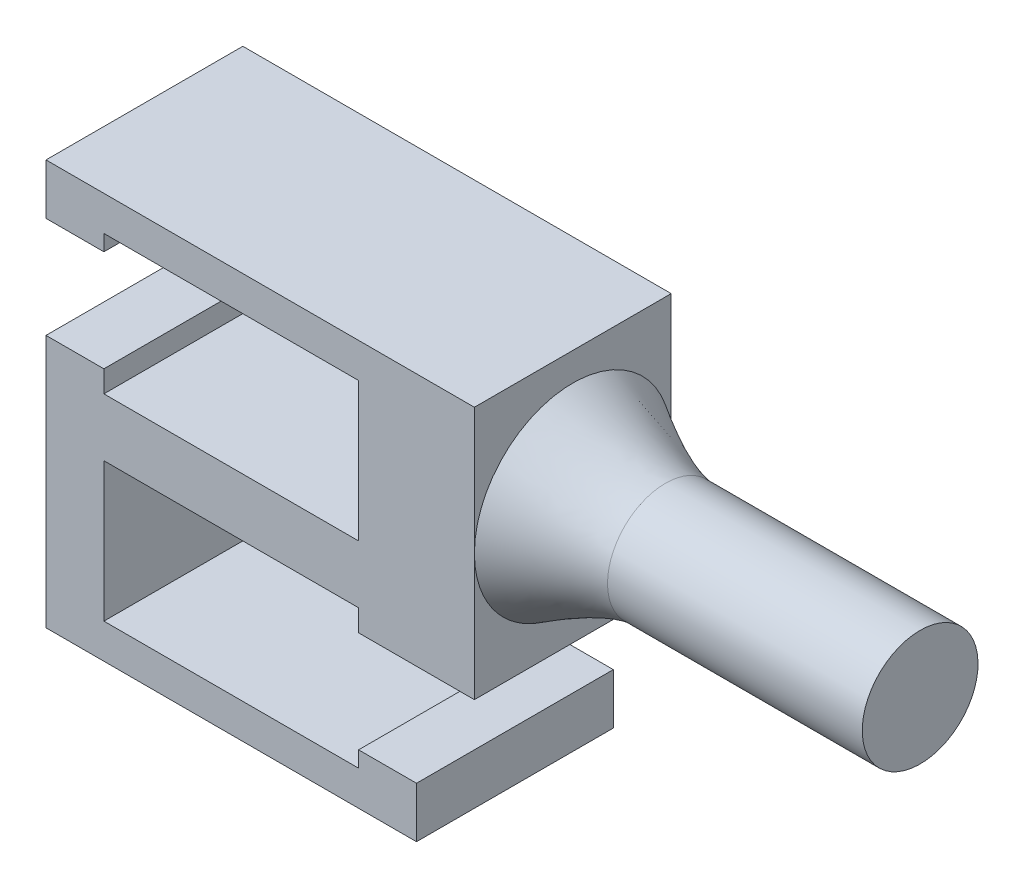
ISO-10303-21;
HEADER;
FILE_DESCRIPTION(('STEP AP214'),'2;1');
FILE_NAME('part.step','',(''),(''),'','','');
FILE_SCHEMA(('AUTOMOTIVE_DESIGN { 1 0 10303 214 1 1 1 1 }'));
ENDSEC;
DATA;
#1=APPLICATION_CONTEXT('core data for automotive mechanical design processes');
#2=APPLICATION_PROTOCOL_DEFINITION('international standard','automotive_design',2000,#1);
#3=PRODUCT_CONTEXT('',#1,'mechanical');
#4=PRODUCT('Part','Part','',(#3));
#5=PRODUCT_RELATED_PRODUCT_CATEGORY('part','',(#4));
#6=PRODUCT_DEFINITION_FORMATION('','',#4);
#7=PRODUCT_DEFINITION_CONTEXT('part definition',#1,'design');
#8=PRODUCT_DEFINITION('design','',#6,#7);
#9=PRODUCT_DEFINITION_SHAPE('','',#8);
#10=(LENGTH_UNIT() NAMED_UNIT(*) SI_UNIT(.MILLI.,.METRE.));
#11=(NAMED_UNIT(*) PLANE_ANGLE_UNIT() SI_UNIT($,.RADIAN.));
#12=(NAMED_UNIT(*) SI_UNIT($,.STERADIAN.) SOLID_ANGLE_UNIT());
#13=UNCERTAINTY_MEASURE_WITH_UNIT(LENGTH_MEASURE(1.E-05),#10,'distance_accuracy_value','');
#14=(GEOMETRIC_REPRESENTATION_CONTEXT(3) GLOBAL_UNCERTAINTY_ASSIGNED_CONTEXT((#13)) GLOBAL_UNIT_ASSIGNED_CONTEXT((#10,
#11,#12)) REPRESENTATION_CONTEXT('',''));
#15=CARTESIAN_POINT('',(0.,0.,0.));
#16=DIRECTION('',(0.,0.,1.));
#17=DIRECTION('',(1.,0.,0.));
#18=AXIS2_PLACEMENT_3D('',#15,#16,#17);
#19=CARTESIAN_POINT('',(21.1122382547684,0.,0.));
#20=DIRECTION('',(1.,0.,0.));
#21=DIRECTION('',(0.,1.,0.));
#22=AXIS2_PLACEMENT_3D('',#19,#20,#21);
#23=PLANE('',#22);
#24=DIRECTION('',(0.,1.,0.));
#25=VECTOR('',#24,1.);
#26=CARTESIAN_POINT('',(21.1122382547684,75.9799365132959,32.));
#27=LINE('',#26,#25);
#28=CARTESIAN_POINT('',(21.1122382547684,54.1049365132959,32.));
#29=VERTEX_POINT('',#28);
#30=CARTESIAN_POINT('',(21.1122382547684,65.0421631936669,32.));
#31=VERTEX_POINT('',#30);
#32=EDGE_CURVE('E224',#29,#31,#27,.T.);
#33=ORIENTED_EDGE('',*,*,#32,.F.);
#34=DIRECTION('',(0.,0.,1.));
#35=VECTOR('',#34,1.);
#36=CARTESIAN_POINT('',(21.1122382547684,54.1049365132959,15.));
#37=LINE('',#36,#35);
#38=CARTESIAN_POINT('',(21.1122382547684,54.1049365132959,15.));
#39=VERTEX_POINT('',#38);
#40=EDGE_CURVE('E207',#39,#29,#37,.T.);
#41=ORIENTED_EDGE('',*,*,#40,.F.);
#42=DIRECTION('',(0.,-1.,0.));
#43=VECTOR('',#42,1.);
#44=CARTESIAN_POINT('',(21.1122382547684,75.9799365132959,15.));
#45=LINE('',#44,#43);
#46=CARTESIAN_POINT('',(21.1122382547684,65.0427098329382,15.));
#47=VERTEX_POINT('',#46);
#48=EDGE_CURVE('E201',#47,#39,#45,.T.);
#49=ORIENTED_EDGE('',*,*,#48,.F.);
#50=CARTESIAN_POINT('',(21.1122382547684,72.8146764351576,20.0587376448433));
#51=CARTESIAN_POINT('',(21.1122382547684,79.697201145471,35.6032174885667));
#52=CARTESIAN_POINT('',(21.1122382547684,64.1527213017475,42.4857421988802));
#53=CARTESIAN_POINT('',(21.1122382547684,57.2701965914341,26.9412623551567));
#54=CARTESIAN_POINT('',(21.1122382547684,50.3876718811207,11.3967825114333));
#55=CARTESIAN_POINT('',(21.1122382547684,65.9321517248442,4.51425780111984));
#56=CARTESIAN_POINT('',(21.1122382547684,72.8146764351576,20.0587376448433));
#57=(BOUNDED_CURVE() B_SPLINE_CURVE(3,(#50,#51,#52,#53,#54,#55,#56),.UNSPECIFIED.,.T.,
.F.) B_SPLINE_CURVE_WITH_KNOTS((4,3,4),(0.,0.5,1.),
.UNSPECIFIED.) CURVE() GEOMETRIC_REPRESENTATION_ITEM() RATIONAL_B_SPLINE_CURVE((1.,
0.333333333333333,0.333333333333333,1.,0.333333333333333,0.333333333333333,1.)) REPRESENTATION_ITEM(''));
#58=EDGE_CURVE('E193',#47,#31,#57,.F.);
#59=ORIENTED_EDGE('',*,*,#58,.T.);
#60=EDGE_LOOP('',(#33,#41,#49,#59));
#61=FACE_BOUND('',#60,.T.);
#62=ADVANCED_FACE('F43',(#61),#23,.T.);
#63=CARTESIAN_POINT('',(21.1122382547684,75.9799365132959,15.));
#64=VERTEX_POINT('',#63);
#65=EDGE_CURVE('E189',#64,#47,#45,.T.);
#66=ORIENTED_EDGE('',*,*,#65,.F.);
#67=DIRECTION('',(0.,0.,-1.));
#68=VECTOR('',#67,1.);
#69=CARTESIAN_POINT('',(21.1122382547684,75.9799365132959,15.));
#70=LINE('',#69,#68);
#71=CARTESIAN_POINT('',(21.1122382547684,75.9799365132959,32.));
#72=VERTEX_POINT('',#71);
#73=EDGE_CURVE('E233',#72,#64,#70,.T.);
#74=ORIENTED_EDGE('',*,*,#73,.F.);
#75=EDGE_CURVE('E191',#31,#72,#27,.T.);
#76=ORIENTED_EDGE('',*,*,#75,.F.);
#77=CARTESIAN_POINT('',(21.1122382547684,65.0424365132959,23.5));
#78=DIRECTION('',(-1.,0.,0.));
#79=DIRECTION('',(0.,1.,0.));
#80=AXIS2_PLACEMENT_3D('',#77,#78,#79);
#81=CIRCLE('',#80,8.49999999999999);
#82=EDGE_CURVE('E59',#31,#47,#81,.T.);
#83=ORIENTED_EDGE('',*,*,#82,.T.);
#84=EDGE_LOOP('',(#66,#74,#76,#83));
#85=FACE_BOUND('',#84,.T.);
#86=ADVANCED_FACE('F187',(#85),#23,.T.);
#87=CARTESIAN_POINT('',(16.1122382547684,0.,35.));
#88=DIRECTION('',(-1.,0.,0.));
#89=DIRECTION('',(0.,-1.,0.));
#90=AXIS2_PLACEMENT_3D('',#87,#88,#89);
#91=PLANE('',#90);
#92=DIRECTION('',(0.,0.,-1.));
#93=VECTOR('',#92,1.);
#94=CARTESIAN_POINT('',(16.1122382547684,40.9799365132959,35.));
#95=LINE('',#94,#93);
#96=CARTESIAN_POINT('',(16.1122382547684,40.9799365132959,32.));
#97=VERTEX_POINT('',#96);
#98=CARTESIAN_POINT('',(16.1122382547684,40.9799365132959,15.));
#99=VERTEX_POINT('',#98);
#100=EDGE_CURVE('E52',#97,#99,#95,.T.);
#101=ORIENTED_EDGE('',*,*,#100,.T.);
#102=DIRECTION('',(0.,1.,0.));
#103=VECTOR('',#102,1.);
#104=CARTESIAN_POINT('',(16.1122382547684,75.9799365132959,15.));
#105=LINE('',#104,#103);
#106=CARTESIAN_POINT('',(16.1122382547684,45.3549365132959,15.));
#107=VERTEX_POINT('',#106);
#108=EDGE_CURVE('E408',#99,#107,#105,.T.);
#109=ORIENTED_EDGE('',*,*,#108,.T.);
#110=DIRECTION('',(0.,0.,1.));
#111=VECTOR('',#110,1.);
#112=CARTESIAN_POINT('',(16.1122382547684,45.3549365132959,35.));
#113=LINE('',#112,#111);
#114=CARTESIAN_POINT('',(16.1122382547684,45.3549365132959,32.));
#115=VERTEX_POINT('',#114);
#116=EDGE_CURVE('E384',#107,#115,#113,.T.);
#117=ORIENTED_EDGE('',*,*,#116,.T.);
#118=DIRECTION('',(0.,1.,0.));
#119=VECTOR('',#118,1.);
#120=CARTESIAN_POINT('',(16.1122382547684,75.9799365132959,32.));
#121=LINE('',#120,#119);
#122=EDGE_CURVE('E477',#97,#115,#121,.T.);
#123=ORIENTED_EDGE('',*,*,#122,.F.);
#124=EDGE_LOOP('',(#101,#109,#117,#123));
#125=FACE_BOUND('',#124,.T.);
#126=ADVANCED_FACE('F289',(#125),#91,.F.);
#127=CARTESIAN_POINT('',(11.1122380163498,0.,35.));
#128=DIRECTION('',(-1.,0.,0.));
#129=DIRECTION('',(0.,0.,-1.));
#130=AXIS2_PLACEMENT_3D('',#127,#128,#129);
#131=PLANE('',#130);
#132=DIRECTION('',(0.,1.,0.));
#133=VECTOR('',#132,1.);
#134=CARTESIAN_POINT('',(11.1122380163498,0.,32.));
#135=LINE('',#134,#133);
#136=CARTESIAN_POINT('',(11.1122380163498,43.9799365132959,32.));
#137=VERTEX_POINT('',#136);
#138=CARTESIAN_POINT('',(11.1122380163498,45.3549365132959,32.));
#139=VERTEX_POINT('',#138);
#140=EDGE_CURVE('E342',#137,#139,#135,.T.);
#141=ORIENTED_EDGE('',*,*,#140,.T.);
#142=DIRECTION('',(0.,0.,1.));
#143=VECTOR('',#142,1.);
#144=CARTESIAN_POINT('',(11.1122380163498,45.3549365132959,35.));
#145=LINE('',#144,#143);
#146=CARTESIAN_POINT('',(11.1122380163498,45.3549365132959,15.));
#147=VERTEX_POINT('',#146);
#148=EDGE_CURVE('E385',#147,#139,#145,.T.);
#149=ORIENTED_EDGE('',*,*,#148,.F.);
#150=DIRECTION('',(0.,-1.,0.));
#151=VECTOR('',#150,1.);
#152=CARTESIAN_POINT('',(11.1122380163498,0.,15.));
#153=LINE('',#152,#151);
#154=CARTESIAN_POINT('',(11.1122380163498,43.9799365132959,15.));
#155=VERTEX_POINT('',#154);
#156=EDGE_CURVE('E348',#147,#155,#153,.T.);
#157=ORIENTED_EDGE('',*,*,#156,.T.);
#158=DIRECTION('',(0.,0.,-1.));
#159=VECTOR('',#158,1.);
#160=CARTESIAN_POINT('',(11.1122380163498,43.9799365132959,35.));
#161=LINE('',#160,#159);
#162=EDGE_CURVE('E336',#137,#155,#161,.T.);
#163=ORIENTED_EDGE('',*,*,#162,.F.);
#164=EDGE_LOOP('',(#141,#149,#157,#163));
#165=FACE_BOUND('',#164,.T.);
#166=ADVANCED_FACE('F292',(#165),#131,.T.);
#167=CARTESIAN_POINT('',(-10.8877619836502,0.,35.));
#168=DIRECTION('',(-1.,0.,0.));
#169=DIRECTION('',(0.,-1.,0.));
#170=AXIS2_PLACEMENT_3D('',#167,#168,#169);
#171=PLANE('',#170);
#172=DIRECTION('',(0.,0.,-1.));
#173=VECTOR('',#172,1.);
#174=CARTESIAN_POINT('',(-10.8877619836502,60.9799365132958,35.));
#175=LINE('',#174,#173);
#176=CARTESIAN_POINT('',(-10.8877619836502,60.9799365132958,32.));
#177=VERTEX_POINT('',#176);
#178=CARTESIAN_POINT('',(-10.8877619836502,60.9799365132959,15.));
#179=VERTEX_POINT('',#178);
#180=EDGE_CURVE('E453',#177,#179,#175,.T.);
#181=ORIENTED_EDGE('',*,*,#180,.T.);
#182=DIRECTION('',(0.,-1.,0.));
#183=VECTOR('',#182,1.);
#184=CARTESIAN_POINT('',(-10.8877619836502,0.,15.));
#185=LINE('',#184,#183);
#186=CARTESIAN_POINT('',(-10.8877619836502,62.8549365132958,15.));
#187=VERTEX_POINT('',#186);
#188=EDGE_CURVE('E441',#187,#179,#185,.T.);
#189=ORIENTED_EDGE('',*,*,#188,.F.);
#190=DIRECTION('',(0.,0.,-1.));
#191=VECTOR('',#190,1.);
#192=CARTESIAN_POINT('',(-10.8877619836502,62.8549365132958,15.));
#193=LINE('',#192,#191);
#194=CARTESIAN_POINT('',(-10.8877619836502,62.8549365132958,32.));
#195=VERTEX_POINT('',#194);
#196=EDGE_CURVE('E395',#195,#187,#193,.T.);
#197=ORIENTED_EDGE('',*,*,#196,.F.);
#198=DIRECTION('',(0.,1.,0.));
#199=VECTOR('',#198,1.);
#200=CARTESIAN_POINT('',(-10.8877619836502,0.,32.));
#201=LINE('',#200,#199);
#202=EDGE_CURVE('E369',#177,#195,#201,.T.);
#203=ORIENTED_EDGE('',*,*,#202,.F.);
#204=EDGE_LOOP('',(#181,#189,#197,#203));
#205=FACE_BOUND('',#204,.T.);
#206=ADVANCED_FACE('F321',(#205),#171,.F.);
#207=CARTESIAN_POINT('',(-15.8877622220688,0.,35.));
#208=DIRECTION('',(-1.,0.,0.));
#209=DIRECTION('',(0.,-1.,0.));
#210=AXIS2_PLACEMENT_3D('',#207,#208,#209);
#211=PLANE('',#210);
#212=DIRECTION('',(0.,1.,0.));
#213=VECTOR('',#212,1.);
#214=CARTESIAN_POINT('',(-15.8877622220688,75.9799365132959,32.));
#215=LINE('',#214,#213);
#216=CARTESIAN_POINT('',(-15.8877622220688,40.9799365132959,32.));
#217=VERTEX_POINT('',#216);
#218=CARTESIAN_POINT('',(-15.8877622220688,62.8549365132958,32.));
#219=VERTEX_POINT('',#218);
#220=EDGE_CURVE('E473',#217,#219,#215,.T.);
#221=ORIENTED_EDGE('',*,*,#220,.T.);
#222=DIRECTION('',(0.,0.,1.));
#223=VECTOR('',#222,1.);
#224=CARTESIAN_POINT('',(-15.8877622220688,62.8549365132958,15.));
#225=LINE('',#224,#223);
#226=CARTESIAN_POINT('',(-15.8877622220688,62.8549365132958,15.));
#227=VERTEX_POINT('',#226);
#228=EDGE_CURVE('E401',#227,#219,#225,.T.);
#229=ORIENTED_EDGE('',*,*,#228,.F.);
#230=DIRECTION('',(0.,1.,0.));
#231=VECTOR('',#230,1.);
#232=CARTESIAN_POINT('',(-15.8877622220688,75.9799365132959,15.));
#233=LINE('',#232,#231);
#234=CARTESIAN_POINT('',(-15.8877622220688,40.9799365132959,15.));
#235=VERTEX_POINT('',#234);
#236=EDGE_CURVE('E412',#235,#227,#233,.T.);
#237=ORIENTED_EDGE('',*,*,#236,.F.);
#238=DIRECTION('',(0.,0.,-1.));
#239=VECTOR('',#238,1.);
#240=CARTESIAN_POINT('',(-15.8877622220688,40.9799365132959,35.));
#241=LINE('',#240,#239);
#242=EDGE_CURVE('E448',#217,#235,#241,.T.);
#243=ORIENTED_EDGE('',*,*,#242,.F.);
#244=EDGE_LOOP('',(#221,#229,#237,#243));
#245=FACE_BOUND('',#244,.T.);
#246=ADVANCED_FACE('F288',(#245),#211,.T.);
#247=CARTESIAN_POINT('',(-15.8877622220688,75.9799365132959,15.));
#248=DIRECTION('',(0.,0.,1.));
#249=DIRECTION('',(0.,1.,0.));
#250=AXIS2_PLACEMENT_3D('',#247,#248,#249);
#251=PLANE('',#250);
#252=ORIENTED_EDGE('',*,*,#108,.F.);
#253=DIRECTION('',(1.,0.,0.));
#254=VECTOR('',#253,1.);
#255=CARTESIAN_POINT('',(-15.8877622220688,40.9799365132959,15.));
#256=LINE('',#255,#254);
#257=EDGE_CURVE('E418',#235,#99,#256,.T.);
#258=ORIENTED_EDGE('',*,*,#257,.F.);
#259=ORIENTED_EDGE('',*,*,#236,.T.);
#260=DIRECTION('',(-1.,0.,0.));
#261=VECTOR('',#260,1.);
#262=CARTESIAN_POINT('',(16.1132382547684,62.8549365132958,15.));
#263=LINE('',#262,#261);
#264=EDGE_CURVE('E404',#187,#227,#263,.T.);
#265=ORIENTED_EDGE('',*,*,#264,.F.);
#266=ORIENTED_EDGE('',*,*,#188,.T.);
#267=DIRECTION('',(1.,0.,0.));
#268=VECTOR('',#267,1.);
#269=CARTESIAN_POINT('',(0.,60.9799365132959,15.));
#270=LINE('',#269,#268);
#271=CARTESIAN_POINT('',(11.1122380163498,60.9799365132958,15.));
#272=VERTEX_POINT('',#271);
#273=EDGE_CURVE('E438',#179,#272,#270,.T.);
#274=ORIENTED_EDGE('',*,*,#273,.T.);
#275=DIRECTION('',(0.,-1.,0.));
#276=VECTOR('',#275,1.);
#277=CARTESIAN_POINT('',(11.1122380163498,0.,15.));
#278=LINE('',#277,#276);
#279=CARTESIAN_POINT('',(11.1122380163498,72.9799365132958,15.));
#280=VERTEX_POINT('',#279);
#281=EDGE_CURVE('E435',#280,#272,#278,.T.);
#282=ORIENTED_EDGE('',*,*,#281,.F.);
#283=DIRECTION('',(-1.,4.06395371900136E-09,0.));
#284=VECTOR('',#283,1.);
#285=CARTESIAN_POINT('',(2.96587084589218E-07,72.9799365584555,15.));
#286=LINE('',#285,#284);
#287=CARTESIAN_POINT('',(-10.8877619836502,72.9799366027028,15.));
#288=VERTEX_POINT('',#287);
#289=EDGE_CURVE('E432',#280,#288,#286,.T.);
#290=ORIENTED_EDGE('',*,*,#289,.T.);
#291=CARTESIAN_POINT('',(-10.8877619836502,71.6049365132959,15.));
#292=VERTEX_POINT('',#291);
#293=EDGE_CURVE('E442',#288,#292,#185,.T.);
#294=ORIENTED_EDGE('',*,*,#293,.T.);
#295=DIRECTION('',(-1.,0.,0.));
#296=VECTOR('',#295,1.);
#297=CARTESIAN_POINT('',(16.1132382547684,71.6049365132959,15.));
#298=LINE('',#297,#296);
#299=CARTESIAN_POINT('',(-15.8877622220688,71.6049365132959,15.));
#300=VERTEX_POINT('',#299);
#301=EDGE_CURVE('E400',#292,#300,#298,.T.);
#302=ORIENTED_EDGE('',*,*,#301,.T.);
#303=CARTESIAN_POINT('',(-15.8877622220688,75.9799365132959,15.));
#304=VERTEX_POINT('',#303);
#305=EDGE_CURVE('E415',#300,#304,#233,.T.);
#306=ORIENTED_EDGE('',*,*,#305,.T.);
#307=DIRECTION('',(1.,0.,0.));
#308=VECTOR('',#307,1.);
#309=CARTESIAN_POINT('',(-15.8877622220688,75.9799365132959,15.));
#310=LINE('',#309,#308);
#311=EDGE_CURVE('E205',#304,#64,#310,.T.);
#312=ORIENTED_EDGE('',*,*,#311,.T.);
#313=ORIENTED_EDGE('',*,*,#65,.T.);
#314=ORIENTED_EDGE('',*,*,#48,.T.);
#315=DIRECTION('',(1.,0.,0.));
#316=VECTOR('',#315,1.);
#317=CARTESIAN_POINT('',(-15.8887622220688,54.1049365132958,15.));
#318=LINE('',#317,#316);
#319=CARTESIAN_POINT('',(11.1122380163498,54.1049365132959,15.));
#320=VERTEX_POINT('',#319);
#321=EDGE_CURVE('E391',#320,#39,#318,.T.);
#322=ORIENTED_EDGE('',*,*,#321,.F.);
#323=CARTESIAN_POINT('',(11.1122380163498,55.9799365132959,15.));
#324=VERTEX_POINT('',#323);
#325=EDGE_CURVE('E424',#324,#320,#153,.T.);
#326=ORIENTED_EDGE('',*,*,#325,.F.);
#327=DIRECTION('',(-1.,0.,0.));
#328=VECTOR('',#327,1.);
#329=CARTESIAN_POINT('',(0.,55.9799365132959,15.));
#330=LINE('',#329,#328);
#331=CARTESIAN_POINT('',(-10.8877619836502,55.9799365132959,15.));
#332=VERTEX_POINT('',#331);
#333=EDGE_CURVE('E420',#324,#332,#330,.T.);
#334=ORIENTED_EDGE('',*,*,#333,.T.);
#335=DIRECTION('',(0.,-1.,0.));
#336=VECTOR('',#335,1.);
#337=CARTESIAN_POINT('',(-10.8877619836502,0.,15.));
#338=LINE('',#337,#336);
#339=CARTESIAN_POINT('',(-10.8877619836502,43.9799365132959,15.));
#340=VERTEX_POINT('',#339);
#341=EDGE_CURVE('E429',#332,#340,#338,.T.);
#342=ORIENTED_EDGE('',*,*,#341,.T.);
#343=DIRECTION('',(-1.,0.,0.));
#344=VECTOR('',#343,1.);
#345=CARTESIAN_POINT('',(0.,43.9799365132959,15.));
#346=LINE('',#345,#344);
#347=EDGE_CURVE('E427',#155,#340,#346,.T.);
#348=ORIENTED_EDGE('',*,*,#347,.F.);
#349=ORIENTED_EDGE('',*,*,#156,.F.);
#350=DIRECTION('',(1.,0.,0.));
#351=VECTOR('',#350,1.);
#352=CARTESIAN_POINT('',(-15.8887622220688,45.3549365132958,15.));
#353=LINE('',#352,#351);
#354=EDGE_CURVE('E393',#147,#107,#353,.T.);
#355=ORIENTED_EDGE('',*,*,#354,.T.);
#356=EDGE_LOOP('',(#252,#258,#259,#265,#266,#274,#282,#290,#294,#302,#306,#312,#313,#314,#322,
#326,#334,#342,#348,#349,#355));
#357=FACE_BOUND('',#356,.T.);
#358=ADVANCED_FACE('F198',(#357),#251,.F.);
#359=CARTESIAN_POINT('',(0.,75.9799365132959,35.));
#360=DIRECTION('',(0.,1.,0.));
#361=DIRECTION('',(0.,0.,-1.));
#362=AXIS2_PLACEMENT_3D('',#359,#360,#361);
#363=PLANE('',#362);
#364=DIRECTION('',(-1.,0.,0.));
#365=VECTOR('',#364,1.);
#366=CARTESIAN_POINT('',(16.1122382547684,75.9799365132959,32.));
#367=LINE('',#366,#365);
#368=CARTESIAN_POINT('',(-15.8877622220688,75.9799365132959,32.));
#369=VERTEX_POINT('',#368);
#370=EDGE_CURVE('E352',#72,#369,#367,.T.);
#371=ORIENTED_EDGE('',*,*,#370,.F.);
#372=ORIENTED_EDGE('',*,*,#73,.T.);
#373=ORIENTED_EDGE('',*,*,#311,.F.);
#374=DIRECTION('',(0.,0.,-1.));
#375=VECTOR('',#374,1.);
#376=CARTESIAN_POINT('',(-15.8877622220688,75.9799365132959,35.));
#377=LINE('',#376,#375);
#378=EDGE_CURVE('E451',#369,#304,#377,.T.);
#379=ORIENTED_EDGE('',*,*,#378,.F.);
#380=EDGE_LOOP('',(#371,#372,#373,#379));
#381=FACE_BOUND('',#380,.T.);
#382=ADVANCED_FACE('F287',(#381),#363,.T.);
#383=CARTESIAN_POINT('',(0.,40.9799365132959,35.));
#384=DIRECTION('',(0.,1.,0.));
#385=DIRECTION('',(0.,0.,-1.));
#386=AXIS2_PLACEMENT_3D('',#383,#384,#385);
#387=PLANE('',#386);
#388=ORIENTED_EDGE('',*,*,#242,.T.);
#389=ORIENTED_EDGE('',*,*,#257,.T.);
#390=ORIENTED_EDGE('',*,*,#100,.F.);
#391=DIRECTION('',(-1.,0.,0.));
#392=VECTOR('',#391,1.);
#393=CARTESIAN_POINT('',(16.1122382547684,40.9799365132959,32.));
#394=LINE('',#393,#392);
#395=EDGE_CURVE('E355',#97,#217,#394,.T.);
#396=ORIENTED_EDGE('',*,*,#395,.T.);
#397=EDGE_LOOP('',(#388,#389,#390,#396));
#398=FACE_BOUND('',#397,.T.);
#399=ADVANCED_FACE('F294',(#398),#387,.F.);
#400=DIRECTION('',(0.,0.,-1.));
#401=VECTOR('',#400,1.);
#402=CARTESIAN_POINT('',(-10.8877619836502,71.6049365132959,15.));
#403=LINE('',#402,#401);
#404=CARTESIAN_POINT('',(-10.8877619836502,71.6049365132959,32.));
#405=VERTEX_POINT('',#404);
#406=EDGE_CURVE('E399',#405,#292,#403,.T.);
#407=ORIENTED_EDGE('',*,*,#406,.T.);
#408=ORIENTED_EDGE('',*,*,#293,.F.);
#409=DIRECTION('',(0.,0.,-1.));
#410=VECTOR('',#409,1.);
#411=CARTESIAN_POINT('',(-10.8877619836502,72.9799366027028,35.));
#412=LINE('',#411,#410);
#413=CARTESIAN_POINT('',(-10.8877619836502,72.9799366027028,32.));
#414=VERTEX_POINT('',#413);
#415=EDGE_CURVE('E460',#414,#288,#412,.T.);
#416=ORIENTED_EDGE('',*,*,#415,.F.);
#417=DIRECTION('',(0.,1.,0.));
#418=VECTOR('',#417,1.);
#419=CARTESIAN_POINT('',(-10.8877619836502,0.,32.));
#420=LINE('',#419,#418);
#421=EDGE_CURVE('E379',#405,#414,#420,.T.);
#422=ORIENTED_EDGE('',*,*,#421,.F.);
#423=EDGE_LOOP('',(#407,#408,#416,#422));
#424=FACE_BOUND('',#423,.T.);
#425=ADVANCED_FACE('F297',(#424),#171,.F.);
#426=CARTESIAN_POINT('',(0.,60.9799365132959,35.));
#427=DIRECTION('',(0.,-1.,0.));
#428=DIRECTION('',(1.,0.,0.));
#429=AXIS2_PLACEMENT_3D('',#426,#427,#428);
#430=PLANE('',#429);
#431=DIRECTION('',(0.,0.,-1.));
#432=VECTOR('',#431,1.);
#433=CARTESIAN_POINT('',(11.1122380163498,60.9799365132958,35.));
#434=LINE('',#433,#432);
#435=CARTESIAN_POINT('',(11.1122380163498,60.9799365132958,32.));
#436=VERTEX_POINT('',#435);
#437=EDGE_CURVE('E456',#436,#272,#434,.T.);
#438=ORIENTED_EDGE('',*,*,#437,.T.);
#439=ORIENTED_EDGE('',*,*,#273,.F.);
#440=ORIENTED_EDGE('',*,*,#180,.F.);
#441=DIRECTION('',(-1.,0.,0.));
#442=VECTOR('',#441,1.);
#443=CARTESIAN_POINT('',(0.,60.9799365132959,32.));
#444=LINE('',#443,#442);
#445=EDGE_CURVE('E372',#436,#177,#444,.T.);
#446=ORIENTED_EDGE('',*,*,#445,.F.);
#447=EDGE_LOOP('',(#438,#439,#440,#446));
#448=FACE_BOUND('',#447,.T.);
#449=ADVANCED_FACE('F305',(#448),#430,.F.);
#450=DIRECTION('',(0.,1.,0.));
#451=VECTOR('',#450,1.);
#452=CARTESIAN_POINT('',(11.1122380163498,0.,32.));
#453=LINE('',#452,#451);
#454=CARTESIAN_POINT('',(11.1122380163498,72.9799365132958,32.));
#455=VERTEX_POINT('',#454);
#456=EDGE_CURVE('E374',#436,#455,#453,.T.);
#457=ORIENTED_EDGE('',*,*,#456,.T.);
#458=DIRECTION('',(0.,0.,-1.));
#459=VECTOR('',#458,1.);
#460=CARTESIAN_POINT('',(11.1122380163498,72.9799365132958,35.));
#461=LINE('',#460,#459);
#462=EDGE_CURVE('E458',#455,#280,#461,.T.);
#463=ORIENTED_EDGE('',*,*,#462,.T.);
#464=ORIENTED_EDGE('',*,*,#281,.T.);
#465=ORIENTED_EDGE('',*,*,#437,.F.);
#466=EDGE_LOOP('',(#457,#463,#464,#465));
#467=FACE_BOUND('',#466,.T.);
#468=ADVANCED_FACE('F308',(#467),#131,.T.);
#469=DIRECTION('',(0.,0.,-1.));
#470=VECTOR('',#469,1.);
#471=CARTESIAN_POINT('',(-10.8877619836502,43.9799365132959,35.));
#472=LINE('',#471,#470);
#473=CARTESIAN_POINT('',(-10.8877619836502,43.9799365132959,32.));
#474=VERTEX_POINT('',#473);
#475=EDGE_CURVE('E338',#474,#340,#472,.T.);
#476=ORIENTED_EDGE('',*,*,#475,.T.);
#477=ORIENTED_EDGE('',*,*,#341,.F.);
#478=DIRECTION('',(0.,0.,-1.));
#479=VECTOR('',#478,1.);
#480=CARTESIAN_POINT('',(-10.8877619836502,55.9799365132959,35.));
#481=LINE('',#480,#479);
#482=CARTESIAN_POINT('',(-10.8877619836502,55.9799365132959,32.));
#483=VERTEX_POINT('',#482);
#484=EDGE_CURVE('E445',#483,#332,#481,.T.);
#485=ORIENTED_EDGE('',*,*,#484,.F.);
#486=DIRECTION('',(0.,1.,0.));
#487=VECTOR('',#486,1.);
#488=CARTESIAN_POINT('',(-10.8877619836502,0.,32.));
#489=LINE('',#488,#487);
#490=EDGE_CURVE('E341',#474,#483,#489,.T.);
#491=ORIENTED_EDGE('',*,*,#490,.F.);
#492=EDGE_LOOP('',(#476,#477,#485,#491));
#493=FACE_BOUND('',#492,.T.);
#494=ADVANCED_FACE('F312',(#493),#171,.F.);
#495=CARTESIAN_POINT('',(0.,43.9799365132959,35.));
#496=DIRECTION('',(0.,1.,0.));
#497=DIRECTION('',(0.,0.,-1.));
#498=AXIS2_PLACEMENT_3D('',#495,#496,#497);
#499=PLANE('',#498);
#500=DIRECTION('',(1.,0.,0.));
#501=VECTOR('',#500,1.);
#502=CARTESIAN_POINT('',(0.,43.9799365132959,32.));
#503=LINE('',#502,#501);
#504=EDGE_CURVE('E333',#474,#137,#503,.T.);
#505=ORIENTED_EDGE('',*,*,#504,.T.);
#506=ORIENTED_EDGE('',*,*,#162,.T.);
#507=ORIENTED_EDGE('',*,*,#347,.T.);
#508=ORIENTED_EDGE('',*,*,#475,.F.);
#509=EDGE_LOOP('',(#505,#506,#507,#508));
#510=FACE_BOUND('',#509,.T.);
#511=ADVANCED_FACE('F322',(#510),#499,.T.);
#512=DIRECTION('',(0.,1.,0.));
#513=VECTOR('',#512,1.);
#514=CARTESIAN_POINT('',(11.1122380163498,0.,32.));
#515=LINE('',#514,#513);
#516=CARTESIAN_POINT('',(11.1122380163498,54.1049365132959,32.));
#517=VERTEX_POINT('',#516);
#518=CARTESIAN_POINT('',(11.1122380163498,55.9799365132959,32.));
#519=VERTEX_POINT('',#518);
#520=EDGE_CURVE('E362',#517,#519,#515,.T.);
#521=ORIENTED_EDGE('',*,*,#520,.T.);
#522=DIRECTION('',(0.,0.,-1.));
#523=VECTOR('',#522,1.);
#524=CARTESIAN_POINT('',(11.1122380163498,55.9799365132959,35.));
#525=LINE('',#524,#523);
#526=EDGE_CURVE('E349',#519,#324,#525,.T.);
#527=ORIENTED_EDGE('',*,*,#526,.T.);
#528=ORIENTED_EDGE('',*,*,#325,.T.);
#529=DIRECTION('',(0.,0.,-1.));
#530=VECTOR('',#529,1.);
#531=CARTESIAN_POINT('',(11.1122380163498,54.1049365132959,35.));
#532=LINE('',#531,#530);
#533=EDGE_CURVE('E387',#517,#320,#532,.T.);
#534=ORIENTED_EDGE('',*,*,#533,.F.);
#535=EDGE_LOOP('',(#521,#527,#528,#534));
#536=FACE_BOUND('',#535,.T.);
#537=ADVANCED_FACE('F314',(#536),#131,.T.);
#538=CARTESIAN_POINT('',(2.96587084589218E-07,72.9799365584555,35.));
#539=DIRECTION('',(4.06395371900136E-09,1.,0.));
#540=DIRECTION('',(-1.,4.06395371900136E-09,0.));
#541=AXIS2_PLACEMENT_3D('',#538,#539,#540);
#542=PLANE('',#541);
#543=ORIENTED_EDGE('',*,*,#415,.T.);
#544=ORIENTED_EDGE('',*,*,#289,.F.);
#545=ORIENTED_EDGE('',*,*,#462,.F.);
#546=DIRECTION('',(1.,-4.06395371900136E-09,0.));
#547=VECTOR('',#546,1.);
#548=CARTESIAN_POINT('',(2.96587084589218E-07,72.9799365584555,32.));
#549=LINE('',#548,#547);
#550=EDGE_CURVE('E377',#414,#455,#549,.T.);
#551=ORIENTED_EDGE('',*,*,#550,.F.);
#552=EDGE_LOOP('',(#543,#544,#545,#551));
#553=FACE_BOUND('',#552,.T.);
#554=ADVANCED_FACE('F315',(#553),#542,.F.);
#555=CARTESIAN_POINT('',(0.,55.9799365132959,35.));
#556=DIRECTION('',(0.,1.,0.));
#557=DIRECTION('',(0.,0.,-1.));
#558=AXIS2_PLACEMENT_3D('',#555,#556,#557);
#559=PLANE('',#558);
#560=ORIENTED_EDGE('',*,*,#484,.T.);
#561=ORIENTED_EDGE('',*,*,#333,.F.);
#562=ORIENTED_EDGE('',*,*,#526,.F.);
#563=DIRECTION('',(1.,0.,0.));
#564=VECTOR('',#563,1.);
#565=CARTESIAN_POINT('',(0.,55.9799365132959,32.));
#566=LINE('',#565,#564);
#567=EDGE_CURVE('E360',#483,#519,#566,.T.);
#568=ORIENTED_EDGE('',*,*,#567,.F.);
#569=EDGE_LOOP('',(#560,#561,#562,#568));
#570=FACE_BOUND('',#569,.T.);
#571=ADVANCED_FACE('F45',(#570),#559,.F.);
#572=CARTESIAN_POINT('',(-15.8877622220688,71.6049365132959,32.));
#573=VERTEX_POINT('',#572);
#574=EDGE_CURVE('E472',#573,#369,#215,.T.);
#575=ORIENTED_EDGE('',*,*,#574,.T.);
#576=ORIENTED_EDGE('',*,*,#378,.T.);
#577=ORIENTED_EDGE('',*,*,#305,.F.);
#578=DIRECTION('',(0.,0.,1.));
#579=VECTOR('',#578,1.);
#580=CARTESIAN_POINT('',(-15.8877622220688,71.6049365132959,15.));
#581=LINE('',#580,#579);
#582=EDGE_CURVE('E396',#300,#573,#581,.T.);
#583=ORIENTED_EDGE('',*,*,#582,.T.);
#584=EDGE_LOOP('',(#575,#576,#577,#583));
#585=FACE_BOUND('',#584,.T.);
#586=ADVANCED_FACE('F280',(#585),#211,.T.);
#587=CARTESIAN_POINT('',(16.1132382547684,71.6049365132959,15.));
#588=DIRECTION('',(0.,1.,0.));
#589=DIRECTION('',(-1.,0.,0.));
#590=AXIS2_PLACEMENT_3D('',#587,#588,#589);
#591=PLANE('',#590);
#592=ORIENTED_EDGE('',*,*,#582,.F.);
#593=ORIENTED_EDGE('',*,*,#301,.F.);
#594=ORIENTED_EDGE('',*,*,#406,.F.);
#595=DIRECTION('',(1.,0.,0.));
#596=VECTOR('',#595,1.);
#597=CARTESIAN_POINT('',(16.1132382547684,71.6049365132959,32.));
#598=LINE('',#597,#596);
#599=EDGE_CURVE('E382',#573,#405,#598,.T.);
#600=ORIENTED_EDGE('',*,*,#599,.F.);
#601=EDGE_LOOP('',(#592,#593,#594,#600));
#602=FACE_BOUND('',#601,.T.);
#603=ADVANCED_FACE('F277',(#602),#591,.F.);
#604=CARTESIAN_POINT('',(16.1132382547684,62.8549365132958,15.));
#605=DIRECTION('',(0.,1.,0.));
#606=DIRECTION('',(-1.,0.,0.));
#607=AXIS2_PLACEMENT_3D('',#604,#605,#606);
#608=PLANE('',#607);
#609=DIRECTION('',(1.,0.,0.));
#610=VECTOR('',#609,1.);
#611=CARTESIAN_POINT('',(16.1132382547684,62.8549365132958,32.));
#612=LINE('',#611,#610);
#613=EDGE_CURVE('E367',#219,#195,#612,.T.);
#614=ORIENTED_EDGE('',*,*,#613,.T.);
#615=ORIENTED_EDGE('',*,*,#196,.T.);
#616=ORIENTED_EDGE('',*,*,#264,.T.);
#617=ORIENTED_EDGE('',*,*,#228,.T.);
#618=EDGE_LOOP('',(#614,#615,#616,#617));
#619=FACE_BOUND('',#618,.T.);
#620=ADVANCED_FACE('F272',(#619),#608,.T.);
#621=CARTESIAN_POINT('',(-15.8887622220688,54.1049365132958,35.));
#622=DIRECTION('',(0.,1.,0.));
#623=DIRECTION('',(-1.,0.,0.));
#624=AXIS2_PLACEMENT_3D('',#621,#622,#623);
#625=PLANE('',#624);
#626=ORIENTED_EDGE('',*,*,#533,.T.);
#627=ORIENTED_EDGE('',*,*,#321,.T.);
#628=ORIENTED_EDGE('',*,*,#40,.T.);
#629=DIRECTION('',(1.,0.,0.));
#630=VECTOR('',#629,1.);
#631=CARTESIAN_POINT('',(-15.8887622220688,54.1049365132958,32.));
#632=LINE('',#631,#630);
#633=EDGE_CURVE('E365',#517,#29,#632,.T.);
#634=ORIENTED_EDGE('',*,*,#633,.F.);
#635=EDGE_LOOP('',(#626,#627,#628,#634));
#636=FACE_BOUND('',#635,.T.);
#637=ADVANCED_FACE('F269',(#636),#625,.F.);
#638=CARTESIAN_POINT('',(-15.8887622220688,45.3549365132958,35.));
#639=DIRECTION('',(0.,-1.,0.));
#640=DIRECTION('',(1.,0.,0.));
#641=AXIS2_PLACEMENT_3D('',#638,#639,#640);
#642=PLANE('',#641);
#643=ORIENTED_EDGE('',*,*,#116,.F.);
#644=ORIENTED_EDGE('',*,*,#354,.F.);
#645=ORIENTED_EDGE('',*,*,#148,.T.);
#646=DIRECTION('',(-1.,0.,0.));
#647=VECTOR('',#646,1.);
#648=CARTESIAN_POINT('',(-15.8887622220688,45.3549365132958,32.));
#649=LINE('',#648,#647);
#650=EDGE_CURVE('E12',#115,#139,#649,.T.);
#651=ORIENTED_EDGE('',*,*,#650,.F.);
#652=EDGE_LOOP('',(#643,#644,#645,#651));
#653=FACE_BOUND('',#652,.T.);
#654=ADVANCED_FACE('F268',(#653),#642,.F.);
#655=CARTESIAN_POINT('',(16.1122382547684,75.9799365132959,32.));
#656=DIRECTION('',(0.,0.,-1.));
#657=DIRECTION('',(0.,-1.,0.));
#658=AXIS2_PLACEMENT_3D('',#655,#656,#657);
#659=PLANE('',#658);
#660=ORIENTED_EDGE('',*,*,#574,.F.);
#661=ORIENTED_EDGE('',*,*,#599,.T.);
#662=ORIENTED_EDGE('',*,*,#421,.T.);
#663=ORIENTED_EDGE('',*,*,#550,.T.);
#664=ORIENTED_EDGE('',*,*,#456,.F.);
#665=ORIENTED_EDGE('',*,*,#445,.T.);
#666=ORIENTED_EDGE('',*,*,#202,.T.);
#667=ORIENTED_EDGE('',*,*,#613,.F.);
#668=ORIENTED_EDGE('',*,*,#220,.F.);
#669=ORIENTED_EDGE('',*,*,#395,.F.);
#670=ORIENTED_EDGE('',*,*,#122,.T.);
#671=ORIENTED_EDGE('',*,*,#650,.T.);
#672=ORIENTED_EDGE('',*,*,#140,.F.);
#673=ORIENTED_EDGE('',*,*,#504,.F.);
#674=ORIENTED_EDGE('',*,*,#490,.T.);
#675=ORIENTED_EDGE('',*,*,#567,.T.);
#676=ORIENTED_EDGE('',*,*,#520,.F.);
#677=ORIENTED_EDGE('',*,*,#633,.T.);
#678=ORIENTED_EDGE('',*,*,#32,.T.);
#679=ORIENTED_EDGE('',*,*,#75,.T.);
#680=ORIENTED_EDGE('',*,*,#370,.T.);
#681=EDGE_LOOP('',(#660,#661,#662,#663,#664,#665,#666,#667,#668,#669,#670,#671,#672,#673,#674,
#675,#676,#677,#678,#679,#680));
#682=FACE_BOUND('',#681,.T.);
#683=ADVANCED_FACE('F258',(#682),#659,.F.);
#684=CARTESIAN_POINT('',(29.1122382547684,67.0021954546326,18.9000712079587));
#685=CARTESIAN_POINT('',(21.1122382547684,72.8146764351576,20.0587376448433));
#686=CARTESIAN_POINT('',(29.1122382547684,76.2020530387152,22.8195890906322));
#687=CARTESIAN_POINT('',(21.1122382547684,79.697201145471,35.6032174885667));
#688=CARTESIAN_POINT('',(29.1122382547684,72.2825351560417,32.0194466747148));
#689=CARTESIAN_POINT('',(21.1122382547684,64.1527213017475,42.4857421988802));
#690=CARTESIAN_POINT('',(29.1122382547684,63.0826775719591,28.0999287920413));
#691=CARTESIAN_POINT('',(21.1122382547684,57.2701965914341,26.9412623551567));
#692=CARTESIAN_POINT('',(29.1122382547684,53.8828199878765,24.1804109093678));
#693=CARTESIAN_POINT('',(21.1122382547684,50.3876718811207,11.3967825114333));
#694=CARTESIAN_POINT('',(29.1122382547684,57.80233787055,14.9805533252852));
#695=CARTESIAN_POINT('',(21.1122382547684,65.9321517248442,4.51425780111984));
#696=CARTESIAN_POINT('',(29.1122382547684,67.0021954546326,18.9000712079587));
#697=CARTESIAN_POINT('',(21.1122382547684,72.8146764351576,20.0587376448433));
#698=(BOUNDED_SURFACE() B_SPLINE_SURFACE(3,1,((#684,#685),(#686,#687),(#688,#689),(#690,#691),
(#692,#693),(#694,#695),(#696,#697)),.UNSPECIFIED.,.T.,.F.,.F.) B_SPLINE_SURFACE_WITH_KNOTS((4,
3,4),(2,2),(0.,0.5,1.),(0.,1.),
.UNSPECIFIED.) GEOMETRIC_REPRESENTATION_ITEM() RATIONAL_B_SPLINE_SURFACE(((1.,1.),
(0.333333333333333,0.333333333333333),(0.333333333333333,0.333333333333333),(1.,1.),
(0.333333333333333,0.333333333333333),(0.333333333333333,0.333333333333333),(1.,1.))) REPRESENTATION_ITEM('') SURFACE());
#699=CARTESIAN_POINT('',(29.1122382547684,67.0021954546326,18.9000712079587));
#700=CARTESIAN_POINT('',(29.1122382547684,57.80233787055,14.9805533252852));
#701=CARTESIAN_POINT('',(29.1122382547684,53.8828199878765,24.1804109093678));
#702=CARTESIAN_POINT('',(29.1122382547684,63.0826775719591,28.0999287920413));
#703=CARTESIAN_POINT('',(29.1122382547684,72.2825351560417,32.0194466747148));
#704=CARTESIAN_POINT('',(29.1122382547684,76.2020530387152,22.8195890906322));
#705=CARTESIAN_POINT('',(29.1122382547684,67.0021954546326,18.9000712079587));
#706=(BOUNDED_CURVE() B_SPLINE_CURVE(3,(#699,#700,#701,#702,#703,#704,#705),.UNSPECIFIED.,.T.,
.F.) B_SPLINE_CURVE_WITH_KNOTS((4,3,4),(0.,0.5,1.),
.UNSPECIFIED.) CURVE() GEOMETRIC_REPRESENTATION_ITEM() RATIONAL_B_SPLINE_CURVE((1.,
0.333333333333333,0.333333333333333,1.,0.333333333333333,0.333333333333333,1.)) REPRESENTATION_ITEM(''));
#707=CARTESIAN_POINT('',(29.1122382547684,67.0021954546326,18.9000712079587));
#708=VERTEX_POINT('',#707);
#709=EDGE_CURVE('E194',#708,#708,#706,.T.);
#710=ORIENTED_EDGE('',*,*,#709,.T.);
#711=EDGE_LOOP('',(#710));
#712=FACE_BOUND('',#711,.T.);
#713=ORIENTED_EDGE('',*,*,#58,.F.);
#714=ORIENTED_EDGE('',*,*,#82,.F.);
#715=EDGE_LOOP('',(#713,#714));
#716=FACE_BOUND('',#715,.T.);
#717=ADVANCED_FACE('F210',(#712,#716),#698,.F.);
#718=CARTESIAN_POINT('',(51.1122382547684,65.0424365132959,23.5));
#719=DIRECTION('',(1.,0.,0.));
#720=DIRECTION('',(0.,1.,0.));
#721=AXIS2_PLACEMENT_3D('',#718,#719,#720);
#722=PLANE('',#721);
#723=CARTESIAN_POINT('',(51.1122382547684,65.0424365132959,23.5));
#724=DIRECTION('',(-1.,0.,0.));
#725=DIRECTION('',(0.,1.,0.));
#726=AXIS2_PLACEMENT_3D('',#723,#724,#725);
#727=CIRCLE('',#726,5.);
#728=CARTESIAN_POINT('',(51.1122382547684,70.0424365132959,23.5));
#729=VERTEX_POINT('',#728);
#730=EDGE_CURVE('E215',#729,#729,#727,.T.);
#731=ORIENTED_EDGE('',*,*,#730,.F.);
#732=EDGE_LOOP('',(#731));
#733=FACE_BOUND('',#732,.T.);
#734=ADVANCED_FACE('F252',(#733),#722,.T.);
#735=CARTESIAN_POINT('',(51.1122382547684,65.0424365132959,23.5));
#736=DIRECTION('',(-1.,0.,0.));
#737=DIRECTION('',(0.,-1.,0.));
#738=AXIS2_PLACEMENT_3D('',#735,#736,#737);
#739=CYLINDRICAL_SURFACE('',#738,5.);
#740=ORIENTED_EDGE('',*,*,#709,.F.);
#741=EDGE_LOOP('',(#740));
#742=FACE_BOUND('',#741,.T.);
#743=ORIENTED_EDGE('',*,*,#730,.T.);
#744=EDGE_LOOP('',(#743));
#745=FACE_BOUND('',#744,.T.);
#746=ADVANCED_FACE('F242',(#742,#745),#739,.T.);
#747=CLOSED_SHELL('',(#62,#86,#126,#166,#206,#246,#358,#382,#399,#425,#449,#468,#494,#511,#537,
#554,#571,#586,#603,#620,#637,#654,#683,#717,#734,#746));
#748=MANIFOLD_SOLID_BREP('B2',#747);
#749=ADVANCED_BREP_SHAPE_REPRESENTATION('',(#18,#748),#14);
#750=SHAPE_DEFINITION_REPRESENTATION(#9,#749);
ENDSEC;
END-ISO-10303-21;
